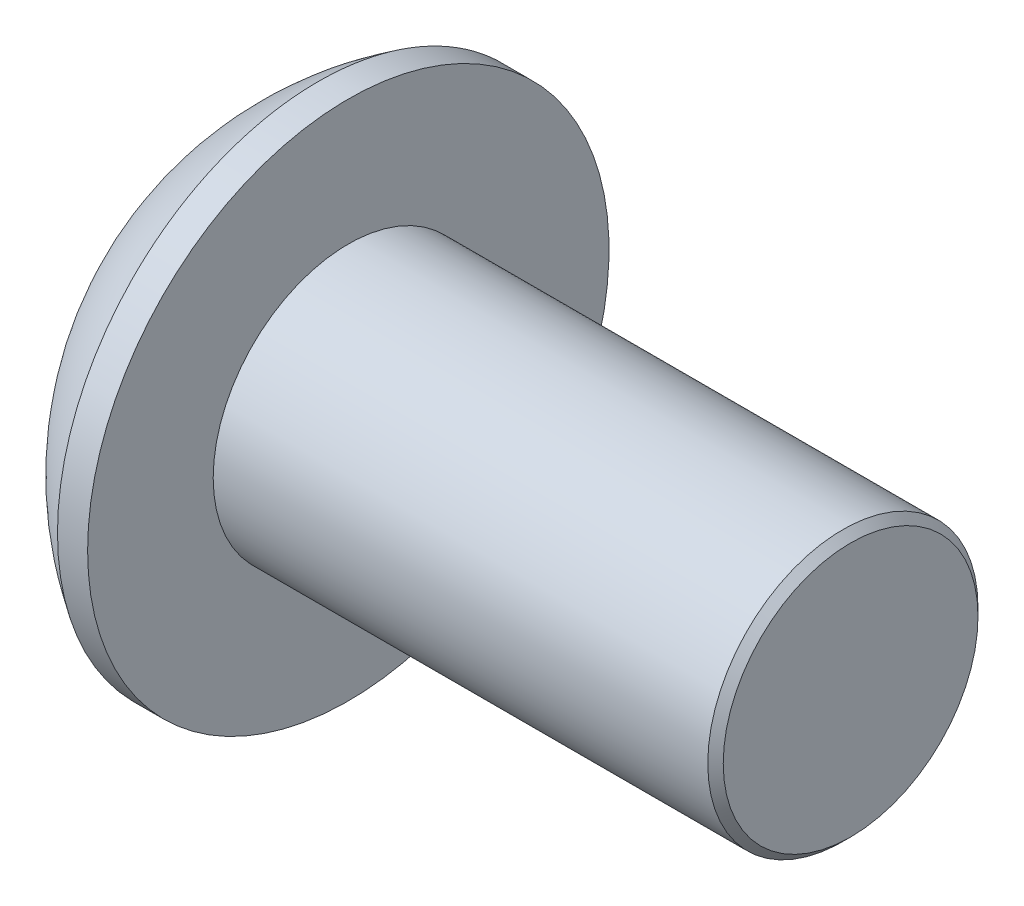
ISO-10303-21;
HEADER;
FILE_DESCRIPTION(('STEP AP214'),'2;1');
FILE_NAME('part.step','',(''),(''),'','','');
FILE_SCHEMA(('AUTOMOTIVE_DESIGN { 1 0 10303 214 1 1 1 1 }'));
ENDSEC;
DATA;
#1=APPLICATION_CONTEXT('core data for automotive mechanical design processes');
#2=APPLICATION_PROTOCOL_DEFINITION('international standard','automotive_design',2000,#1);
#3=PRODUCT_CONTEXT('',#1,'mechanical');
#4=PRODUCT('Part','Part','',(#3));
#5=PRODUCT_RELATED_PRODUCT_CATEGORY('part','',(#4));
#6=PRODUCT_DEFINITION_FORMATION('','',#4);
#7=PRODUCT_DEFINITION_CONTEXT('part definition',#1,'design');
#8=PRODUCT_DEFINITION('design','',#6,#7);
#9=PRODUCT_DEFINITION_SHAPE('','',#8);
#10=(LENGTH_UNIT() NAMED_UNIT(*) SI_UNIT(.MILLI.,.METRE.));
#11=(NAMED_UNIT(*) PLANE_ANGLE_UNIT() SI_UNIT($,.RADIAN.));
#12=(NAMED_UNIT(*) SI_UNIT($,.STERADIAN.) SOLID_ANGLE_UNIT());
#13=UNCERTAINTY_MEASURE_WITH_UNIT(LENGTH_MEASURE(1.E-05),#10,'distance_accuracy_value','');
#14=(GEOMETRIC_REPRESENTATION_CONTEXT(3) GLOBAL_UNCERTAINTY_ASSIGNED_CONTEXT((#13)) GLOBAL_UNIT_ASSIGNED_CONTEXT((#10,
#11,#12)) REPRESENTATION_CONTEXT('',''));
#15=CARTESIAN_POINT('',(0.,0.,0.));
#16=DIRECTION('',(0.,0.,1.));
#17=DIRECTION('',(1.,0.,0.));
#18=AXIS2_PLACEMENT_3D('',#15,#16,#17);
#19=CARTESIAN_POINT('',(1.32080000000034,0.,0.));
#20=DIRECTION('',(-1.,0.,0.));
#21=DIRECTION('',(0.,0.,1.));
#22=AXIS2_PLACEMENT_3D('',#19,#20,#21);
#23=CONICAL_SURFACE('',#22,1.1937999999998,1.04719755119608);
#24=CARTESIAN_POINT('',(2.01004075135902,0.,4.44089209850063E-13));
#25=VERTEX_POINT('',#24);
#26=VERTEX_LOOP('',#25);
#27=FACE_BOUND('',#26,.T.);
#28=CARTESIAN_POINT('',(1.32080000000009,0.,0.));
#29=DIRECTION('',(-1.,0.,0.));
#30=DIRECTION('',(0.,0.,1.));
#31=AXIS2_PLACEMENT_3D('',#28,#29,#30);
#32=CIRCLE('',#31,1.19380000000024);
#33=CARTESIAN_POINT('',(1.32080000000004,-1.03386112703797,0.59690000000006));
#34=VERTEX_POINT('',#33);
#35=CARTESIAN_POINT('',(1.32080000000004,0.,1.19380000000012));
#36=VERTEX_POINT('',#35);
#37=EDGE_CURVE('E21',#34,#36,#32,.T.);
#38=ORIENTED_EDGE('',*,*,#37,.T.);
#39=CARTESIAN_POINT('',(1.32080000000009,0.,0.));
#40=DIRECTION('',(-1.,0.,0.));
#41=DIRECTION('',(0.,0.,1.));
#42=AXIS2_PLACEMENT_3D('',#39,#40,#41);
#43=CIRCLE('',#42,1.19380000000024);
#44=CARTESIAN_POINT('',(1.32080000000004,1.03386112703797,0.596900000000061));
#45=VERTEX_POINT('',#44);
#46=EDGE_CURVE('E149',#36,#45,#43,.T.);
#47=ORIENTED_EDGE('',*,*,#46,.T.);
#48=CARTESIAN_POINT('',(1.32080000000009,0.,0.));
#49=DIRECTION('',(-1.,0.,0.));
#50=DIRECTION('',(0.,0.,1.));
#51=AXIS2_PLACEMENT_3D('',#48,#49,#50);
#52=CIRCLE('',#51,1.19380000000024);
#53=CARTESIAN_POINT('',(1.32080000000004,1.03386112703797,-0.596900000000061));
#54=VERTEX_POINT('',#53);
#55=EDGE_CURVE('E406',#45,#54,#52,.T.);
#56=ORIENTED_EDGE('',*,*,#55,.T.);
#57=CARTESIAN_POINT('',(1.32080000000009,0.,0.));
#58=DIRECTION('',(-1.,0.,0.));
#59=DIRECTION('',(0.,0.,1.));
#60=AXIS2_PLACEMENT_3D('',#57,#58,#59);
#61=CIRCLE('',#60,1.19380000000024);
#62=CARTESIAN_POINT('',(1.32080000000004,1.49457637585666E-12,-1.19380000000012));
#63=VERTEX_POINT('',#62);
#64=EDGE_CURVE('E407',#54,#63,#61,.T.);
#65=ORIENTED_EDGE('',*,*,#64,.T.);
#66=CARTESIAN_POINT('',(1.32080000000009,0.,0.));
#67=DIRECTION('',(-1.,0.,0.));
#68=DIRECTION('',(0.,0.,1.));
#69=AXIS2_PLACEMENT_3D('',#66,#67,#68);
#70=CIRCLE('',#69,1.19380000000024);
#71=CARTESIAN_POINT('',(1.32080000000004,-1.03386112703797,-0.596900000000061));
#72=VERTEX_POINT('',#71);
#73=EDGE_CURVE('E94',#63,#72,#70,.T.);
#74=ORIENTED_EDGE('',*,*,#73,.T.);
#75=CARTESIAN_POINT('',(1.32080000000009,0.,0.));
#76=DIRECTION('',(-1.,0.,0.));
#77=DIRECTION('',(0.,0.,1.));
#78=AXIS2_PLACEMENT_3D('',#75,#76,#77);
#79=CIRCLE('',#78,1.19380000000024);
#80=EDGE_CURVE('E90',#72,#34,#79,.T.);
#81=ORIENTED_EDGE('',*,*,#80,.T.);
#82=EDGE_LOOP('',(#38,#47,#56,#65,#74,#81));
#83=FACE_BOUND('',#82,.T.);
#84=ADVANCED_FACE('F18',(#27,#83),#23,.F.);
#85=CARTESIAN_POINT('',(1.3208,-2.06772225407573,-1.1938));
#86=DIRECTION('',(1.,0.,0.));
#87=DIRECTION('',(0.,0.,-1.));
#88=AXIS2_PLACEMENT_3D('',#85,#86,#87);
#89=PLANE('',#88);
#90=DIRECTION('',(0.,0.5,0.866025403784439));
#91=VECTOR('',#90,1.);
#92=CARTESIAN_POINT('',(1.3208,-1.37848150271715,0.));
#93=LINE('',#92,#91);
#94=CARTESIAN_POINT('',(1.3208,-0.689240751358575,1.1938));
#95=VERTEX_POINT('',#94);
#96=EDGE_CURVE('E102',#95,#34,#93,.F.);
#97=ORIENTED_EDGE('',*,*,#96,.F.);
#98=DIRECTION('',(0.,1.,0.));
#99=VECTOR('',#98,1.);
#100=CARTESIAN_POINT('',(1.3208,-0.689240751358575,1.1938));
#101=LINE('',#100,#99);
#102=EDGE_CURVE('E104',#36,#95,#101,.F.);
#103=ORIENTED_EDGE('',*,*,#102,.F.);
#104=ORIENTED_EDGE('',*,*,#37,.F.);
#105=EDGE_LOOP('',(#97,#103,#104));
#106=FACE_BOUND('',#105,.T.);
#107=ADVANCED_FACE('F100',(#106),#89,.F.);
#108=CARTESIAN_POINT('',(1.3208,-2.06772225407573,-1.1938));
#109=DIRECTION('',(1.,0.,0.));
#110=DIRECTION('',(0.,0.,-1.));
#111=AXIS2_PLACEMENT_3D('',#108,#109,#110);
#112=PLANE('',#111);
#113=DIRECTION('',(0.,-0.5,0.866025403784439));
#114=VECTOR('',#113,1.);
#115=CARTESIAN_POINT('',(1.3208,-0.689240751358575,-1.1938));
#116=LINE('',#115,#114);
#117=CARTESIAN_POINT('',(1.3208,-1.37848150271715,0.));
#118=VERTEX_POINT('',#117);
#119=EDGE_CURVE('E110',#118,#72,#116,.F.);
#120=ORIENTED_EDGE('',*,*,#119,.F.);
#121=DIRECTION('',(0.,0.5,0.866025403784439));
#122=VECTOR('',#121,1.);
#123=CARTESIAN_POINT('',(1.3208,-1.37848150271715,0.));
#124=LINE('',#123,#122);
#125=EDGE_CURVE('E107',#34,#118,#124,.F.);
#126=ORIENTED_EDGE('',*,*,#125,.F.);
#127=ORIENTED_EDGE('',*,*,#80,.F.);
#128=EDGE_LOOP('',(#120,#126,#127));
#129=FACE_BOUND('',#128,.T.);
#130=ADVANCED_FACE('F108',(#129),#112,.F.);
#131=CARTESIAN_POINT('',(1.3208,-2.06772225407573,-1.1938));
#132=DIRECTION('',(1.,0.,0.));
#133=DIRECTION('',(0.,0.,-1.));
#134=AXIS2_PLACEMENT_3D('',#131,#132,#133);
#135=PLANE('',#134);
#136=DIRECTION('',(0.,1.,0.));
#137=VECTOR('',#136,1.);
#138=CARTESIAN_POINT('',(1.3208,0.689240751358575,-1.1938));
#139=LINE('',#138,#137);
#140=CARTESIAN_POINT('',(1.3208,-0.689240751358575,-1.1938));
#141=VERTEX_POINT('',#140);
#142=EDGE_CURVE('E377',#141,#63,#139,.T.);
#143=ORIENTED_EDGE('',*,*,#142,.F.);
#144=DIRECTION('',(0.,-0.5,0.866025403784439));
#145=VECTOR('',#144,1.);
#146=CARTESIAN_POINT('',(1.3208,-0.689240751358575,-1.1938));
#147=LINE('',#146,#145);
#148=EDGE_CURVE('E389',#72,#141,#147,.F.);
#149=ORIENTED_EDGE('',*,*,#148,.F.);
#150=ORIENTED_EDGE('',*,*,#73,.F.);
#151=EDGE_LOOP('',(#143,#149,#150));
#152=FACE_BOUND('',#151,.T.);
#153=ADVANCED_FACE('F192',(#152),#135,.F.);
#154=CARTESIAN_POINT('',(1.3208,-2.06772225407573,-1.1938));
#155=DIRECTION('',(1.,0.,0.));
#156=DIRECTION('',(0.,0.,-1.));
#157=AXIS2_PLACEMENT_3D('',#154,#155,#156);
#158=PLANE('',#157);
#159=DIRECTION('',(0.,-0.5,-0.866025403784439));
#160=VECTOR('',#159,1.);
#161=CARTESIAN_POINT('',(1.3208,1.37848150271715,0.));
#162=LINE('',#161,#160);
#163=CARTESIAN_POINT('',(1.3208,0.689240751358575,-1.1938));
#164=VERTEX_POINT('',#163);
#165=EDGE_CURVE('E363',#164,#54,#162,.F.);
#166=ORIENTED_EDGE('',*,*,#165,.F.);
#167=DIRECTION('',(0.,1.,0.));
#168=VECTOR('',#167,1.);
#169=CARTESIAN_POINT('',(1.3208,0.689240751358575,-1.1938));
#170=LINE('',#169,#168);
#171=EDGE_CURVE('E374',#63,#164,#170,.T.);
#172=ORIENTED_EDGE('',*,*,#171,.F.);
#173=ORIENTED_EDGE('',*,*,#64,.F.);
#174=EDGE_LOOP('',(#166,#172,#173));
#175=FACE_BOUND('',#174,.T.);
#176=ADVANCED_FACE('F188',(#175),#158,.F.);
#177=CARTESIAN_POINT('',(1.3208,-2.06772225407573,-1.1938));
#178=DIRECTION('',(1.,0.,0.));
#179=DIRECTION('',(0.,0.,-1.));
#180=AXIS2_PLACEMENT_3D('',#177,#178,#179);
#181=PLANE('',#180);
#182=DIRECTION('',(0.,0.5,-0.866025403784439));
#183=VECTOR('',#182,1.);
#184=CARTESIAN_POINT('',(1.3208,0.689240751358575,1.1938));
#185=LINE('',#184,#183);
#186=CARTESIAN_POINT('',(1.3208,1.37848150271715,0.));
#187=VERTEX_POINT('',#186);
#188=EDGE_CURVE('E342',#187,#45,#185,.F.);
#189=ORIENTED_EDGE('',*,*,#188,.F.);
#190=DIRECTION('',(0.,-0.5,-0.866025403784439));
#191=VECTOR('',#190,1.);
#192=CARTESIAN_POINT('',(1.3208,1.37848150271715,0.));
#193=LINE('',#192,#191);
#194=EDGE_CURVE('E361',#54,#187,#193,.F.);
#195=ORIENTED_EDGE('',*,*,#194,.F.);
#196=ORIENTED_EDGE('',*,*,#55,.F.);
#197=EDGE_LOOP('',(#189,#195,#196));
#198=FACE_BOUND('',#197,.T.);
#199=ADVANCED_FACE('F184',(#198),#181,.F.);
#200=CARTESIAN_POINT('',(1.3208,-2.06772225407573,-1.1938));
#201=DIRECTION('',(1.,0.,0.));
#202=DIRECTION('',(0.,0.,-1.));
#203=AXIS2_PLACEMENT_3D('',#200,#201,#202);
#204=PLANE('',#203);
#205=DIRECTION('',(0.,1.,0.));
#206=VECTOR('',#205,1.);
#207=CARTESIAN_POINT('',(1.3208,-0.689240751358575,1.1938));
#208=LINE('',#207,#206);
#209=CARTESIAN_POINT('',(1.3208,0.689240751358575,1.1938));
#210=VERTEX_POINT('',#209);
#211=EDGE_CURVE('E119',#210,#36,#208,.F.);
#212=ORIENTED_EDGE('',*,*,#211,.F.);
#213=DIRECTION('',(0.,0.5,-0.866025403784439));
#214=VECTOR('',#213,1.);
#215=CARTESIAN_POINT('',(1.3208,0.689240751358575,1.1938));
#216=LINE('',#215,#214);
#217=EDGE_CURVE('E345',#45,#210,#216,.F.);
#218=ORIENTED_EDGE('',*,*,#217,.F.);
#219=ORIENTED_EDGE('',*,*,#46,.F.);
#220=EDGE_LOOP('',(#212,#218,#219));
#221=FACE_BOUND('',#220,.T.);
#222=ADVANCED_FACE('F180',(#221),#204,.F.);
#223=CARTESIAN_POINT('',(1.3208,-0.689240751358575,1.1938));
#224=DIRECTION('',(0.,0.,-1.));
#225=DIRECTION('',(0.,1.,0.));
#226=AXIS2_PLACEMENT_3D('',#223,#224,#225);
#227=PLANE('',#226);
#228=DIRECTION('',(0.,1.,0.));
#229=VECTOR('',#228,1.);
#230=CARTESIAN_POINT('',(0.,0.,1.1938));
#231=LINE('',#230,#229);
#232=CARTESIAN_POINT('',(0.,0.689240751358575,1.1938));
#233=VERTEX_POINT('',#232);
#234=CARTESIAN_POINT('',(0.,-0.689240751358575,1.1938));
#235=VERTEX_POINT('',#234);
#236=EDGE_CURVE('E339',#233,#235,#231,.F.);
#237=ORIENTED_EDGE('',*,*,#236,.F.);
#238=DIRECTION('',(1.,0.,0.));
#239=VECTOR('',#238,1.);
#240=CARTESIAN_POINT('',(1.3208,0.689240751358575,1.1938));
#241=LINE('',#240,#239);
#242=EDGE_CURVE('E351',#210,#233,#241,.F.);
#243=ORIENTED_EDGE('',*,*,#242,.F.);
#244=ORIENTED_EDGE('',*,*,#211,.T.);
#245=ORIENTED_EDGE('',*,*,#102,.T.);
#246=DIRECTION('',(1.,0.,0.));
#247=VECTOR('',#246,1.);
#248=CARTESIAN_POINT('',(1.3208,-0.689240751358575,1.1938));
#249=LINE('',#248,#247);
#250=EDGE_CURVE('E113',#235,#95,#249,.T.);
#251=ORIENTED_EDGE('',*,*,#250,.F.);
#252=EDGE_LOOP('',(#237,#243,#244,#245,#251));
#253=FACE_BOUND('',#252,.T.);
#254=ADVANCED_FACE('F177',(#253),#227,.T.);
#255=CARTESIAN_POINT('',(1.3208,-1.37848150271715,0.));
#256=DIRECTION('',(0.,0.866025403784439,-0.5));
#257=DIRECTION('',(0.,0.5,0.866025403784439));
#258=AXIS2_PLACEMENT_3D('',#255,#256,#257);
#259=PLANE('',#258);
#260=DIRECTION('',(0.,-0.5,-0.866025403784439));
#261=VECTOR('',#260,1.);
#262=CARTESIAN_POINT('',(0.,-0.689240751358575,1.1938));
#263=LINE('',#262,#261);
#264=CARTESIAN_POINT('',(0.,-1.37848150271715,0.));
#265=VERTEX_POINT('',#264);
#266=EDGE_CURVE('E336',#235,#265,#263,.T.);
#267=ORIENTED_EDGE('',*,*,#266,.F.);
#268=ORIENTED_EDGE('',*,*,#250,.T.);
#269=ORIENTED_EDGE('',*,*,#96,.T.);
#270=ORIENTED_EDGE('',*,*,#125,.T.);
#271=DIRECTION('',(1.,0.,0.));
#272=VECTOR('',#271,1.);
#273=CARTESIAN_POINT('',(1.3208,-1.37848150271715,0.));
#274=LINE('',#273,#272);
#275=EDGE_CURVE('E386',#265,#118,#274,.T.);
#276=ORIENTED_EDGE('',*,*,#275,.F.);
#277=EDGE_LOOP('',(#267,#268,#269,#270,#276));
#278=FACE_BOUND('',#277,.T.);
#279=ADVANCED_FACE('F117',(#278),#259,.T.);
#280=CARTESIAN_POINT('',(1.3208,-0.689240751358575,-1.1938));
#281=DIRECTION('',(0.,0.866025403784439,0.5));
#282=DIRECTION('',(0.,-0.5,0.866025403784439));
#283=AXIS2_PLACEMENT_3D('',#280,#281,#282);
#284=PLANE('',#283);
#285=DIRECTION('',(0.,0.5,-0.866025403784439));
#286=VECTOR('',#285,1.);
#287=CARTESIAN_POINT('',(0.,-1.37848150271715,0.));
#288=LINE('',#287,#286);
#289=CARTESIAN_POINT('',(0.,-0.689240751358575,-1.1938));
#290=VERTEX_POINT('',#289);
#291=EDGE_CURVE('E333',#265,#290,#288,.T.);
#292=ORIENTED_EDGE('',*,*,#291,.F.);
#293=ORIENTED_EDGE('',*,*,#275,.T.);
#294=ORIENTED_EDGE('',*,*,#119,.T.);
#295=ORIENTED_EDGE('',*,*,#148,.T.);
#296=DIRECTION('',(1.,0.,0.));
#297=VECTOR('',#296,1.);
#298=CARTESIAN_POINT('',(1.3208,-0.689240751358575,-1.1938));
#299=LINE('',#298,#297);
#300=EDGE_CURVE('E371',#290,#141,#299,.T.);
#301=ORIENTED_EDGE('',*,*,#300,.F.);
#302=EDGE_LOOP('',(#292,#293,#294,#295,#301));
#303=FACE_BOUND('',#302,.T.);
#304=ADVANCED_FACE('F170',(#303),#284,.T.);
#305=CARTESIAN_POINT('',(1.3208,0.689240751358575,-1.1938));
#306=DIRECTION('',(0.,0.,1.));
#307=DIRECTION('',(1.,0.,0.));
#308=AXIS2_PLACEMENT_3D('',#305,#306,#307);
#309=PLANE('',#308);
#310=DIRECTION('',(0.,1.,0.));
#311=VECTOR('',#310,1.);
#312=CARTESIAN_POINT('',(0.,0.,-1.1938));
#313=LINE('',#312,#311);
#314=CARTESIAN_POINT('',(0.,0.689240751358575,-1.1938));
#315=VERTEX_POINT('',#314);
#316=EDGE_CURVE('E330',#290,#315,#313,.T.);
#317=ORIENTED_EDGE('',*,*,#316,.F.);
#318=ORIENTED_EDGE('',*,*,#300,.T.);
#319=ORIENTED_EDGE('',*,*,#142,.T.);
#320=ORIENTED_EDGE('',*,*,#171,.T.);
#321=DIRECTION('',(1.,0.,0.));
#322=VECTOR('',#321,1.);
#323=CARTESIAN_POINT('',(1.3208,0.689240751358575,-1.1938));
#324=LINE('',#323,#322);
#325=EDGE_CURVE('E346',#315,#164,#324,.T.);
#326=ORIENTED_EDGE('',*,*,#325,.F.);
#327=EDGE_LOOP('',(#317,#318,#319,#320,#326));
#328=FACE_BOUND('',#327,.T.);
#329=ADVANCED_FACE('F167',(#328),#309,.T.);
#330=CARTESIAN_POINT('',(1.3208,1.37848150271715,0.));
#331=DIRECTION('',(0.,-0.866025403784439,0.5));
#332=DIRECTION('',(0.,-0.5,-0.866025403784439));
#333=AXIS2_PLACEMENT_3D('',#330,#331,#332);
#334=PLANE('',#333);
#335=DIRECTION('',(0.,0.5,0.866025403784439));
#336=VECTOR('',#335,1.);
#337=CARTESIAN_POINT('',(0.,0.689240751358575,-1.1938));
#338=LINE('',#337,#336);
#339=CARTESIAN_POINT('',(0.,1.37848150271715,0.));
#340=VERTEX_POINT('',#339);
#341=EDGE_CURVE('E327',#315,#340,#338,.T.);
#342=ORIENTED_EDGE('',*,*,#341,.F.);
#343=ORIENTED_EDGE('',*,*,#325,.T.);
#344=ORIENTED_EDGE('',*,*,#165,.T.);
#345=ORIENTED_EDGE('',*,*,#194,.T.);
#346=DIRECTION('',(1.,0.,0.));
#347=VECTOR('',#346,1.);
#348=CARTESIAN_POINT('',(1.3208,1.37848150271715,0.));
#349=LINE('',#348,#347);
#350=EDGE_CURVE('E36',#340,#187,#349,.T.);
#351=ORIENTED_EDGE('',*,*,#350,.F.);
#352=EDGE_LOOP('',(#342,#343,#344,#345,#351));
#353=FACE_BOUND('',#352,.T.);
#354=ADVANCED_FACE('F163',(#353),#334,.T.);
#355=CARTESIAN_POINT('',(1.3208,0.689240751358575,1.1938));
#356=DIRECTION('',(0.,-0.866025403784439,-0.5));
#357=DIRECTION('',(0.,0.5,-0.866025403784439));
#358=AXIS2_PLACEMENT_3D('',#355,#356,#357);
#359=PLANE('',#358);
#360=DIRECTION('',(0.,-0.5,0.866025403784439));
#361=VECTOR('',#360,1.);
#362=CARTESIAN_POINT('',(0.,1.37848150271715,0.));
#363=LINE('',#362,#361);
#364=EDGE_CURVE('E148',#340,#233,#363,.T.);
#365=ORIENTED_EDGE('',*,*,#364,.F.);
#366=ORIENTED_EDGE('',*,*,#350,.T.);
#367=ORIENTED_EDGE('',*,*,#188,.T.);
#368=ORIENTED_EDGE('',*,*,#217,.T.);
#369=ORIENTED_EDGE('',*,*,#242,.T.);
#370=EDGE_LOOP('',(#365,#366,#367,#368,#369));
#371=FACE_BOUND('',#370,.T.);
#372=ADVANCED_FACE('F159',(#371),#359,.T.);
#373=CARTESIAN_POINT('',(0.,0.,0.));
#374=DIRECTION('',(-1.,0.,0.));
#375=DIRECTION('',(0.,0.,1.));
#376=AXIS2_PLACEMENT_3D('',#373,#374,#375);
#377=PLANE('',#376);
#378=ORIENTED_EDGE('',*,*,#341,.T.);
#379=ORIENTED_EDGE('',*,*,#364,.T.);
#380=ORIENTED_EDGE('',*,*,#236,.T.);
#381=ORIENTED_EDGE('',*,*,#266,.T.);
#382=ORIENTED_EDGE('',*,*,#291,.T.);
#383=ORIENTED_EDGE('',*,*,#316,.T.);
#384=EDGE_LOOP('',(#378,#379,#380,#381,#382,#383));
#385=FACE_BOUND('',#384,.T.);
#386=CARTESIAN_POINT('',(0.,1.647825,0.));
#387=CARTESIAN_POINT('',(1.63519156892115E-13,1.64781976319874,0.0924902039777532));
#388=CARTESIAN_POINT('',(1.3280260282674E-13,1.63999511633709,0.18514501432637));
#389=CARTESIAN_POINT('',(0.,1.6167119250047,0.322075808080014));
#390=CARTESIAN_POINT('',(-1.58318794569898E-13,1.60700618770234,0.367435533396361));
#391=CARTESIAN_POINT('',(1.5888139631505E-13,1.58380101865853,0.457220935695141));
#392=CARTESIAN_POINT('',(5.68557833423821E-13,1.57029850831031,0.501645823115264));
#393=CARTESIAN_POINT('',(9.3616121179063E-13,1.52428156574313,0.632817459278968));
#394=CARTESIAN_POINT('',(0.,1.48621992666366,0.717681965518643));
#395=CARTESIAN_POINT('',(0.,1.39637079695658,0.879809706624016));
#396=CARTESIAN_POINT('',(7.82242536497637E-13,1.34458278455109,0.957072652379996));
#397=CARTESIAN_POINT('',(4.86953568155855E-13,1.25777784714522,1.06558770210238));
#398=CARTESIAN_POINT('',(1.33447060642817E-13,1.22729946114794,1.10054993332365));
#399=CARTESIAN_POINT('',(-1.32884925775019E-13,1.16354004969107,1.16775237388221));
#400=CARTESIAN_POINT('',(0.,1.13026175473033,1.19999517515816));
#401=CARTESIAN_POINT('',(0.,1.02649304340867,1.29236218866442));
#402=CARTESIAN_POINT('',(0.,0.952049986714079,1.34814848277713));
#403=CARTESIAN_POINT('',(0.,0.794895196754069,1.44639825105766));
#404=CARTESIAN_POINT('',(0.,0.712183775431297,1.48886222758992));
#405=CARTESIAN_POINT('',(0.,0.54079662426573,1.55930919813143));
#406=CARTESIAN_POINT('',(0.,0.452120958135286,1.58729234680269));
#407=CARTESIAN_POINT('',(0.,0.271332331080317,1.62797191307414));
#408=CARTESIAN_POINT('',(0.,0.179219351801789,1.64066824903626));
#409=CARTESIAN_POINT('',(0.,-0.00583077027840882,1.65041748705409));
#410=CARTESIAN_POINT('',(0.,-0.0987679130800783,1.64747038910979));
#411=CARTESIAN_POINT('',(0.,-0.282830196388826,1.62601274134436));
#412=CARTESIAN_POINT('',(0.,-0.37395534657002,1.60750227463794));
#413=CARTESIAN_POINT('',(0.,-0.551796068178806,1.55545413364524));
#414=CARTESIAN_POINT('',(0.,-0.638511592498167,1.52191629885844));
#415=CARTESIAN_POINT('',(0.,-0.805120175533155,1.44072378052347));
#416=CARTESIAN_POINT('',(0.,-0.885012976819958,1.39306856461393));
#417=CARTESIAN_POINT('',(0.,-0.997912879588362,1.31211658756413));
#418=CARTESIAN_POINT('',(0.,-1.0343949246834,1.28354906167735));
#419=CARTESIAN_POINT('',(0.,-1.10486279842069,1.2234182930371));
#420=CARTESIAN_POINT('',(0.,-1.13884618403291,1.19185218578118));
#421=CARTESIAN_POINT('',(0.,-1.23657300939909,1.09305906467359));
#422=CARTESIAN_POINT('',(0.,-1.29619288399357,1.02166556658613));
#423=CARTESIAN_POINT('',(0.,-1.40258050817756,0.869876423478036));
#424=CARTESIAN_POINT('',(0.,-1.44934874627767,0.789481120793481));
#425=CARTESIAN_POINT('',(0.,-1.50889406070376,0.663870959313344));
#426=CARTESIAN_POINT('',(0.,-1.52698985473587,0.621110806760431));
#427=CARTESIAN_POINT('',(0.,-1.55950093966665,0.534260776864334));
#428=CARTESIAN_POINT('',(-1.04973140146496E-13,-1.57391920916438,0.490172008203172));
#429=CARTESIAN_POINT('',(2.10045254706393E-13,-1.6114617790958,0.356445777718599));
#430=CARTESIAN_POINT('',(1.14250083706093E-12,-1.62897899568075,0.265126085962908));
#431=CARTESIAN_POINT('',(4.34054466733687E-13,-1.64174347214909,0.144386595969389));
#432=CARTESIAN_POINT('',(1.21340306256601E-13,-1.64402207668917,0.115560405797875));
#433=CARTESIAN_POINT('',(-1.20906625387681E-13,-1.64706365940121,0.0578281757252701));
#434=CARTESIAN_POINT('',(0.,-1.64782663757319,0.0289221358241782));
#435=CARTESIAN_POINT('',(1.64941431812562E-13,-1.64781976319875,-0.0924902039777541));
#436=CARTESIAN_POINT('',(1.33069267383729E-13,-1.6399951163371,-0.185145014326371));
#437=CARTESIAN_POINT('',(0.,-1.61671192500471,-0.322075808080015));
#438=CARTESIAN_POINT('',(-1.58362753759592E-13,-1.60700618770235,-0.367435533396362));
#439=CARTESIAN_POINT('',(1.58925391252273E-13,-1.58380101865854,-0.457220935695142));
#440=CARTESIAN_POINT('',(5.68599984465805E-13,-1.57029850831032,-0.501645823115265));
#441=CARTESIAN_POINT('',(9.360771106357E-13,-1.52428156574314,-0.632817459278968));
#442=CARTESIAN_POINT('',(0.,-1.48621992666367,-0.717681965518644));
#443=CARTESIAN_POINT('',(0.,-1.39637079695659,-0.879809706624018));
#444=CARTESIAN_POINT('',(7.83473156940465E-13,-1.3445827845511,-0.957072652379998));
#445=CARTESIAN_POINT('',(4.87639062539118E-13,-1.25777784714523,-1.06558770210238));
#446=CARTESIAN_POINT('',(1.33633557334351E-13,-1.22729946114795,-1.10054993332365));
#447=CARTESIAN_POINT('',(-1.33071242655653E-13,-1.16354004969107,-1.16775237388221));
#448=CARTESIAN_POINT('',(0.,-1.13026175473034,-1.19999517515816));
#449=CARTESIAN_POINT('',(0.,-1.02649304340868,-1.29236218866442));
#450=CARTESIAN_POINT('',(0.,-0.95204998671409,-1.34814848277713));
#451=CARTESIAN_POINT('',(0.,-0.79489519675408,-1.44639825105766));
#452=CARTESIAN_POINT('',(0.,-0.712183775431308,-1.48886222758992));
#453=CARTESIAN_POINT('',(0.,-0.540796624265741,-1.55930919813143));
#454=CARTESIAN_POINT('',(0.,-0.452120958135297,-1.58729234680269));
#455=CARTESIAN_POINT('',(0.,-0.271332331080327,-1.62797191307414));
#456=CARTESIAN_POINT('',(0.,-0.179219351801799,-1.64066824903626));
#457=CARTESIAN_POINT('',(0.,0.00583077027839878,-1.65041748705409));
#458=CARTESIAN_POINT('',(0.,0.0987679130800683,-1.64747038910979));
#459=CARTESIAN_POINT('',(0.,0.282830196388816,-1.62601274134436));
#460=CARTESIAN_POINT('',(0.,0.37395534657001,-1.60750227463795));
#461=CARTESIAN_POINT('',(0.,0.551796068178796,-1.55545413364524));
#462=CARTESIAN_POINT('',(0.,0.638511592498158,-1.52191629885844));
#463=CARTESIAN_POINT('',(0.,0.805120175533146,-1.44072378052347));
#464=CARTESIAN_POINT('',(0.,0.885012976819948,-1.39306856461394));
#465=CARTESIAN_POINT('',(0.,0.997912879588351,-1.31211658756413));
#466=CARTESIAN_POINT('',(0.,1.03439492468339,-1.28354906167735));
#467=CARTESIAN_POINT('',(0.,1.10486279842068,-1.2234182930371));
#468=CARTESIAN_POINT('',(0.,1.1388461840329,-1.19185218578118));
#469=CARTESIAN_POINT('',(0.,1.23657300939908,-1.09305906467359));
#470=CARTESIAN_POINT('',(0.,1.29619288399356,-1.02166556658613));
#471=CARTESIAN_POINT('',(0.,1.40258050817755,-0.869876423478035));
#472=CARTESIAN_POINT('',(0.,1.44934874627766,-0.789481120793481));
#473=CARTESIAN_POINT('',(0.,1.50889406070375,-0.663870959313343));
#474=CARTESIAN_POINT('',(0.,1.52698985473586,-0.62111080676043));
#475=CARTESIAN_POINT('',(0.,1.55950093966664,-0.534260776864333));
#476=CARTESIAN_POINT('',(-1.0525400134382E-13,1.57391920916438,-0.49017200820317));
#477=CARTESIAN_POINT('',(2.10605504450137E-13,1.61146177909579,-0.356445777718598));
#478=CARTESIAN_POINT('',(1.14555106174587E-12,1.62897899568074,-0.265126085962907));
#479=CARTESIAN_POINT('',(4.3537782659486E-13,1.64174347214909,-0.144386595969388));
#480=CARTESIAN_POINT('',(1.21880186581217E-13,1.64402207668916,-0.115560405797875));
#481=CARTESIAN_POINT('',(-1.21446505712297E-13,1.6470636594012,-0.0578281757252703));
#482=CARTESIAN_POINT('',(0.,1.64782663757318,-0.0289221358241787));
#483=CARTESIAN_POINT('',(0.,1.647825,0.));
#484=B_SPLINE_CURVE_WITH_KNOTS('',3,(#386,#387,#388,#389,#390,#391,#392,#393,#394,#395,#396,
#397,#398,#399,#400,#401,#402,#403,#404,#405,#406,#407,#408,#409,#410,#411,#412,#413,#414,#415,
#416,#417,#418,#419,#420,#421,#422,#423,#424,#425,#426,#427,#428,#429,#430,#431,#432,#433,#434,
#435,#436,#437,#438,#439,#440,#441,#442,#443,#444,#445,#446,#447,#448,#449,#450,#451,#452,#453,
#454,#455,#456,#457,#458,#459,#460,#461,#462,#463,#464,#465,#466,#467,#468,#469,#470,#471,#472,
#473,#474,#475,#476,#477,#478,#479,#480,#481,#482,#483),.UNSPECIFIED.,.T.,.F.,(4,2,2,2,2,2,2,2,
2,2,2,2,2,2,2,2,2,2,2,2,2,2,2,2,2,2,2,2,2,2,2,2,2,2,2,2,2,2,2,2,2,2,2,2,2,2,2,2,4),(0.,
0.277336029422427,0.416368541537112,0.555514114625601,0.833141970294988,1.11078038089036,
1.24978149120748,1.38864858351854,1.66629367015056,1.94392828594775,2.22155993641642,
2.49919306954938,2.77682620268235,3.05445785315102,3.33209246894821,3.60973755557991,
3.74860464789075,3.88760575820768,4.16524416880333,4.44287202447289,4.58201759756162,
4.72105010967663,4.99838613909884,5.08511046196678,5.17183478483478,5.44917081425721,
5.58820332637189,5.72734889946038,6.00497675512977,6.28261516572515,6.42161627604226,
6.56048336835333,6.83812845498534,7.11576307078253,7.39339472125121,7.67102785438416,
7.94866098751713,8.2262926379858,8.50392725378299,8.78157234041469,8.92043943272553,
9.05944054304246,9.33707895363812,9.61470680930767,9.7538523823964,9.89288489451142,
10.1702209239336,10.2569452468016,10.3436695696696),.UNSPECIFIED.);
#485=CARTESIAN_POINT('',(0.,1.647825,0.));
#486=VERTEX_POINT('',#485);
#487=EDGE_CURVE('E141',#486,#486,#484,.T.);
#488=ORIENTED_EDGE('',*,*,#487,.F.);
#489=EDGE_LOOP('',(#488));
#490=FACE_BOUND('',#489,.T.);
#491=ADVANCED_FACE('F155',(#385,#490),#377,.T.);
#492=CARTESIAN_POINT('',(3.50132362607759,0.,0.));
#493=DIRECTION('',(0.,1.,0.));
#494=DIRECTION('',(1.,0.,0.));
#495=AXIS2_PLACEMENT_3D('',#492,#493,#494);
#496=SPHERICAL_SURFACE('',#495,3.86970210289554);
#497=CARTESIAN_POINT('',(1.4732,0.,0.));
#498=DIRECTION('',(-1.,0.,0.));
#499=DIRECTION('',(0.,0.,1.));
#500=AXIS2_PLACEMENT_3D('',#497,#498,#499);
#501=CIRCLE('',#500,3.29565);
#502=CARTESIAN_POINT('',(1.4732,0.,3.29565));
#503=VERTEX_POINT('',#502);
#504=EDGE_CURVE('E138',#503,#503,#501,.F.);
#505=ORIENTED_EDGE('',*,*,#504,.F.);
#506=EDGE_LOOP('',(#505));
#507=FACE_BOUND('',#506,.T.);
#508=ORIENTED_EDGE('',*,*,#487,.T.);
#509=EDGE_LOOP('',(#508));
#510=FACE_BOUND('',#509,.T.);
#511=ADVANCED_FACE('F151',(#507,#510),#496,.T.);
#512=CARTESIAN_POINT('',(8.2042,0.,0.));
#513=DIRECTION('',(-1.,0.,0.));
#514=DIRECTION('',(0.,0.,1.));
#515=AXIS2_PLACEMENT_3D('',#512,#513,#514);
#516=PLANE('',#515);
#517=CARTESIAN_POINT('',(8.20420000002287,0.,0.));
#518=DIRECTION('',(-1.,0.,0.));
#519=DIRECTION('',(0.,0.,1.));
#520=AXIS2_PLACEMENT_3D('',#517,#518,#519);
#521=CIRCLE('',#520,1.61036000002923);
#522=CARTESIAN_POINT('',(8.20420000002287,0.,1.61036000002923));
#523=VERTEX_POINT('',#522);
#524=EDGE_CURVE('E135',#523,#523,#521,.T.);
#525=ORIENTED_EDGE('',*,*,#524,.F.);
#526=EDGE_LOOP('',(#525));
#527=FACE_BOUND('',#526,.T.);
#528=ADVANCED_FACE('F222',(#527),#516,.F.);
#529=CARTESIAN_POINT('',(0.,0.,0.));
#530=DIRECTION('',(-1.,0.,0.));
#531=DIRECTION('',(0.,0.,1.));
#532=AXIS2_PLACEMENT_3D('',#529,#530,#531);
#533=CYLINDRICAL_SURFACE('',#532,3.29565);
#534=ORIENTED_EDGE('',*,*,#504,.T.);
#535=EDGE_LOOP('',(#534));
#536=FACE_BOUND('',#535,.T.);
#537=CARTESIAN_POINT('',(1.8542,0.,0.));
#538=DIRECTION('',(-1.,0.,0.));
#539=DIRECTION('',(0.,0.,1.));
#540=AXIS2_PLACEMENT_3D('',#537,#538,#539);
#541=CIRCLE('',#540,3.29565);
#542=CARTESIAN_POINT('',(1.8542,0.,3.29565));
#543=VERTEX_POINT('',#542);
#544=EDGE_CURVE('E132',#543,#543,#541,.T.);
#545=ORIENTED_EDGE('',*,*,#544,.T.);
#546=EDGE_LOOP('',(#545));
#547=FACE_BOUND('',#546,.T.);
#548=ADVANCED_FACE('F219',(#536,#547),#533,.T.);
#549=CARTESIAN_POINT('',(8.10641000003898,0.,0.));
#550=DIRECTION('',(-1.,0.,0.));
#551=DIRECTION('',(0.,0.,1.));
#552=AXIS2_PLACEMENT_3D('',#549,#550,#551);
#553=CONICAL_SURFACE('',#552,1.70814999995628,0.785398163106808);
#554=CARTESIAN_POINT('',(8.10641000000005,0.,0.));
#555=DIRECTION('',(-1.,0.,0.));
#556=DIRECTION('',(0.,0.,1.));
#557=AXIS2_PLACEMENT_3D('',#554,#555,#556);
#558=CIRCLE('',#557,1.70814999999999);
#559=CARTESIAN_POINT('',(8.10641000000005,0.,1.70814999999999));
#560=VERTEX_POINT('',#559);
#561=EDGE_CURVE('E27',#560,#560,#558,.T.);
#562=ORIENTED_EDGE('',*,*,#561,.F.);
#563=EDGE_LOOP('',(#562));
#564=FACE_BOUND('',#563,.T.);
#565=ORIENTED_EDGE('',*,*,#524,.T.);
#566=EDGE_LOOP('',(#565));
#567=FACE_BOUND('',#566,.T.);
#568=ADVANCED_FACE('F212',(#564,#567),#553,.T.);
#569=CARTESIAN_POINT('',(1.8542,1.70814999999999,0.));
#570=DIRECTION('',(-1.,0.,0.));
#571=DIRECTION('',(0.,0.,1.));
#572=AXIS2_PLACEMENT_3D('',#569,#570,#571);
#573=PLANE('',#572);
#574=CARTESIAN_POINT('',(1.8542,0.,0.));
#575=DIRECTION('',(-1.,0.,0.));
#576=DIRECTION('',(0.,0.,1.));
#577=AXIS2_PLACEMENT_3D('',#574,#575,#576);
#578=CIRCLE('',#577,1.70814999999999);
#579=CARTESIAN_POINT('',(1.8542,0.,1.70814999999999));
#580=VERTEX_POINT('',#579);
#581=EDGE_CURVE('E11',#580,#580,#578,.F.);
#582=ORIENTED_EDGE('',*,*,#581,.F.);
#583=EDGE_LOOP('',(#582));
#584=FACE_BOUND('',#583,.T.);
#585=ORIENTED_EDGE('',*,*,#544,.F.);
#586=EDGE_LOOP('',(#585));
#587=FACE_BOUND('',#586,.T.);
#588=ADVANCED_FACE('F206',(#584,#587),#573,.F.);
#589=CARTESIAN_POINT('',(0.,0.,0.));
#590=DIRECTION('',(-1.,0.,0.));
#591=DIRECTION('',(0.,0.,1.));
#592=AXIS2_PLACEMENT_3D('',#589,#590,#591);
#593=CYLINDRICAL_SURFACE('',#592,1.70814999999999);
#594=ORIENTED_EDGE('',*,*,#581,.T.);
#595=EDGE_LOOP('',(#594));
#596=FACE_BOUND('',#595,.T.);
#597=ORIENTED_EDGE('',*,*,#561,.T.);
#598=EDGE_LOOP('',(#597));
#599=FACE_BOUND('',#598,.T.);
#600=ADVANCED_FACE('F204',(#596,#599),#593,.T.);
#601=CLOSED_SHELL('',(#84,#107,#130,#153,#176,#199,#222,#254,#279,#304,#329,#354,#372,#491,#511,
#528,#548,#568,#588,#600));
#602=MANIFOLD_SOLID_BREP('B1',#601);
#603=ADVANCED_BREP_SHAPE_REPRESENTATION('',(#18,#602),#14);
#604=SHAPE_DEFINITION_REPRESENTATION(#9,#603);
ENDSEC;
END-ISO-10303-21;
